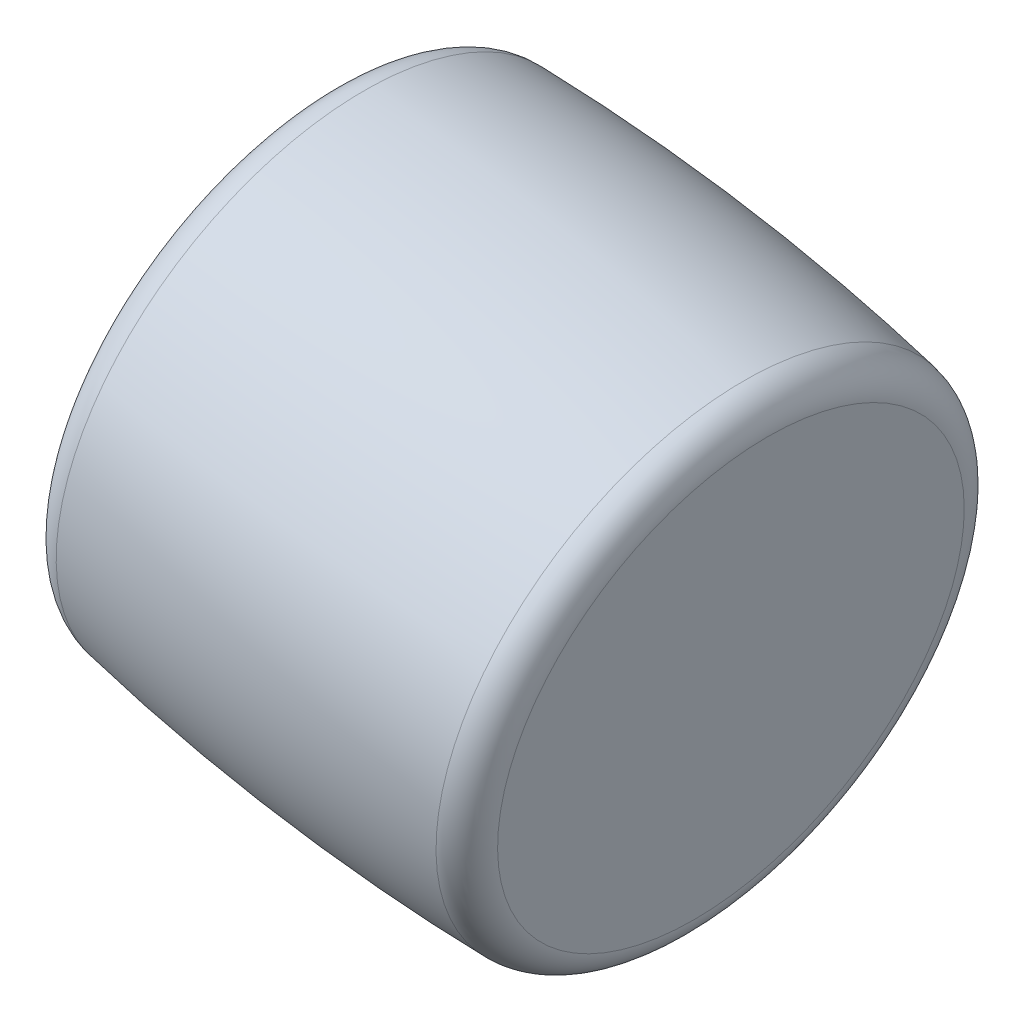
ISO-10303-21;
HEADER;
FILE_DESCRIPTION(('STEP AP214'),'2;1');
FILE_NAME('part.step','',(''),(''),'','','');
FILE_SCHEMA(('AUTOMOTIVE_DESIGN { 1 0 10303 214 1 1 1 1 }'));
ENDSEC;
DATA;
#1=APPLICATION_CONTEXT('core data for automotive mechanical design processes');
#2=APPLICATION_PROTOCOL_DEFINITION('international standard','automotive_design',2000,#1);
#3=PRODUCT_CONTEXT('',#1,'mechanical');
#4=PRODUCT('Part','Part','',(#3));
#5=PRODUCT_RELATED_PRODUCT_CATEGORY('part','',(#4));
#6=PRODUCT_DEFINITION_FORMATION('','',#4);
#7=PRODUCT_DEFINITION_CONTEXT('part definition',#1,'design');
#8=PRODUCT_DEFINITION('design','',#6,#7);
#9=PRODUCT_DEFINITION_SHAPE('','',#8);
#10=(LENGTH_UNIT() NAMED_UNIT(*) SI_UNIT(.MILLI.,.METRE.));
#11=(NAMED_UNIT(*) PLANE_ANGLE_UNIT() SI_UNIT($,.RADIAN.));
#12=(NAMED_UNIT(*) SI_UNIT($,.STERADIAN.) SOLID_ANGLE_UNIT());
#13=UNCERTAINTY_MEASURE_WITH_UNIT(LENGTH_MEASURE(1.E-05),#10,'distance_accuracy_value','');
#14=(GEOMETRIC_REPRESENTATION_CONTEXT(3) GLOBAL_UNCERTAINTY_ASSIGNED_CONTEXT((#13)) GLOBAL_UNIT_ASSIGNED_CONTEXT((#10,
#11,#12)) REPRESENTATION_CONTEXT('',''));
#15=CARTESIAN_POINT('',(0.,0.,0.));
#16=DIRECTION('',(0.,0.,1.));
#17=DIRECTION('',(1.,0.,0.));
#18=AXIS2_PLACEMENT_3D('',#15,#16,#17);
#19=CARTESIAN_POINT('',(15.9157705447534,44.0364333284327,0.));
#20=DIRECTION('',(0.987229020436228,-0.159307442414116,0.));
#21=DIRECTION('',(0.159307442414116,0.987229020436228,0.));
#22=AXIS2_PLACEMENT_3D('',#19,#20,#21);
#23=PLANE('',#22);
#24=CARTESIAN_POINT('',(15.9157705447534,44.0364333284327,0.));
#25=DIRECTION('',(-0.987229020436228,0.159307442414116,0.));
#26=DIRECTION('',(-0.159307442414116,-0.987229020436228,0.));
#27=AXIS2_PLACEMENT_3D('',#24,#25,#26);
#28=CIRCLE('',#27,5.35109540419305);
#29=CARTESIAN_POINT('',(15.0633012217975,38.7536766542904,0.));
#30=VERTEX_POINT('',#29);
#31=EDGE_CURVE('E10',#30,#30,#28,.T.);
#32=ORIENTED_EDGE('',*,*,#31,.T.);
#33=EDGE_LOOP('',(#32));
#34=FACE_BOUND('',#33,.T.);
#35=ADVANCED_FACE('F28',(#34),#23,.F.);
#36=CARTESIAN_POINT('',(16.6561923100805,43.9169527466221,0.));
#37=DIRECTION('',(-0.987229020436228,0.159307442414116,0.));
#38=DIRECTION('',(-0.159307442414116,-0.987229020436228,0.));
#39=AXIS2_PLACEMENT_3D('',#36,#37,#38);
#40=TOROIDAL_SURFACE('',#39,5.35109540419316,0.749999999999957);
#41=ORIENTED_EDGE('',*,*,#31,.F.);
#42=EDGE_LOOP('',(#41));
#43=FACE_BOUND('',#42,.T.);
#44=CARTESIAN_POINT('',(16.5893864255004,43.9277330968654,0.));
#45=DIRECTION('',(-0.987229020436228,0.159307442414116,0.));
#46=DIRECTION('',(-0.159307442414116,-0.987229020436228,0.));
#47=AXIS2_PLACEMENT_3D('',#44,#45,#46);
#48=CIRCLE('',#47,6.09803633748978);
#49=CARTESIAN_POINT('',(15.6179238528265,37.9075746568209,0.));
#50=VERTEX_POINT('',#49);
#51=EDGE_CURVE('E34',#50,#50,#48,.T.);
#52=ORIENTED_EDGE('',*,*,#51,.T.);
#53=EDGE_LOOP('',(#52));
#54=FACE_BOUND('',#53,.T.);
#55=ADVANCED_FACE('F60',(#43,#54),#40,.T.);
#56=CARTESIAN_POINT('',(21.0000000000007,43.2159999999999,0.));
#57=DIRECTION('',(-0.987229020436228,0.159307442414116,0.));
#58=DIRECTION('',(-0.159307442414116,-0.987229020436228,0.));
#59=AXIS2_PLACEMENT_3D('',#56,#57,#58);
#60=DEGENERATE_TOROIDAL_SURFACE('',#59,43.2159999999905,49.5159999999906,.F.);
#61=ORIENTED_EDGE('',*,*,#51,.F.);
#62=EDGE_LOOP('',(#61));
#63=FACE_BOUND('',#62,.T.);
#64=CARTESIAN_POINT('',(25.4106135744996,42.5042669031345,0.));
#65=DIRECTION('',(-0.987229020436228,0.159307442414116,0.));
#66=DIRECTION('',(-0.159307442414116,-0.987229020436228,0.));
#67=AXIS2_PLACEMENT_3D('',#64,#65,#66);
#68=CIRCLE('',#67,6.09803633748989);
#69=CARTESIAN_POINT('',(24.4391510018258,36.4841084630899,0.));
#70=VERTEX_POINT('',#69);
#71=EDGE_CURVE('E38',#70,#70,#68,.T.);
#72=ORIENTED_EDGE('',*,*,#71,.T.);
#73=EDGE_LOOP('',(#72));
#74=FACE_BOUND('',#73,.T.);
#75=ADVANCED_FACE('F56',(#63,#74),#60,.F.);
#76=CARTESIAN_POINT('',(25.3438076899193,42.5150472533779,0.));
#77=DIRECTION('',(-0.987229020436228,0.159307442414116,0.));
#78=DIRECTION('',(-0.159307442414116,-0.987229020436228,0.));
#79=AXIS2_PLACEMENT_3D('',#76,#77,#78);
#80=TOROIDAL_SURFACE('',#79,5.35109540419309,0.750000000000142);
#81=ORIENTED_EDGE('',*,*,#71,.F.);
#82=EDGE_LOOP('',(#81));
#83=FACE_BOUND('',#82,.T.);
#84=CARTESIAN_POINT('',(26.0842294552466,42.3955666715673,0.));
#85=DIRECTION('',(-0.987229020436228,0.159307442414116,0.));
#86=DIRECTION('',(-0.159307442414116,-0.987229020436228,0.));
#87=AXIS2_PLACEMENT_3D('',#84,#85,#86);
#88=CIRCLE('',#87,5.35109540419314);
#89=CARTESIAN_POINT('',(25.2317601322906,37.1128099974249,0.));
#90=VERTEX_POINT('',#89);
#91=EDGE_CURVE('E42',#90,#90,#88,.T.);
#92=ORIENTED_EDGE('',*,*,#91,.T.);
#93=EDGE_LOOP('',(#92));
#94=FACE_BOUND('',#93,.T.);
#95=ADVANCED_FACE('F48',(#83,#94),#80,.T.);
#96=CARTESIAN_POINT('',(26.9366987782025,47.6783233457097,0.));
#97=DIRECTION('',(-0.987229020436228,0.159307442414116,0.));
#98=DIRECTION('',(-0.159307442414116,-0.987229020436228,0.));
#99=AXIS2_PLACEMENT_3D('',#96,#97,#98);
#100=PLANE('',#99);
#101=ORIENTED_EDGE('',*,*,#91,.F.);
#102=EDGE_LOOP('',(#101));
#103=FACE_BOUND('',#102,.T.);
#104=ADVANCED_FACE('F50',(#103),#100,.F.);
#105=CLOSED_SHELL('',(#35,#55,#75,#95,#104));
#106=MANIFOLD_SOLID_BREP('B2',#105);
#107=ADVANCED_BREP_SHAPE_REPRESENTATION('',(#18,#106),#14);
#108=SHAPE_DEFINITION_REPRESENTATION(#9,#107);
ENDSEC;
END-ISO-10303-21;
